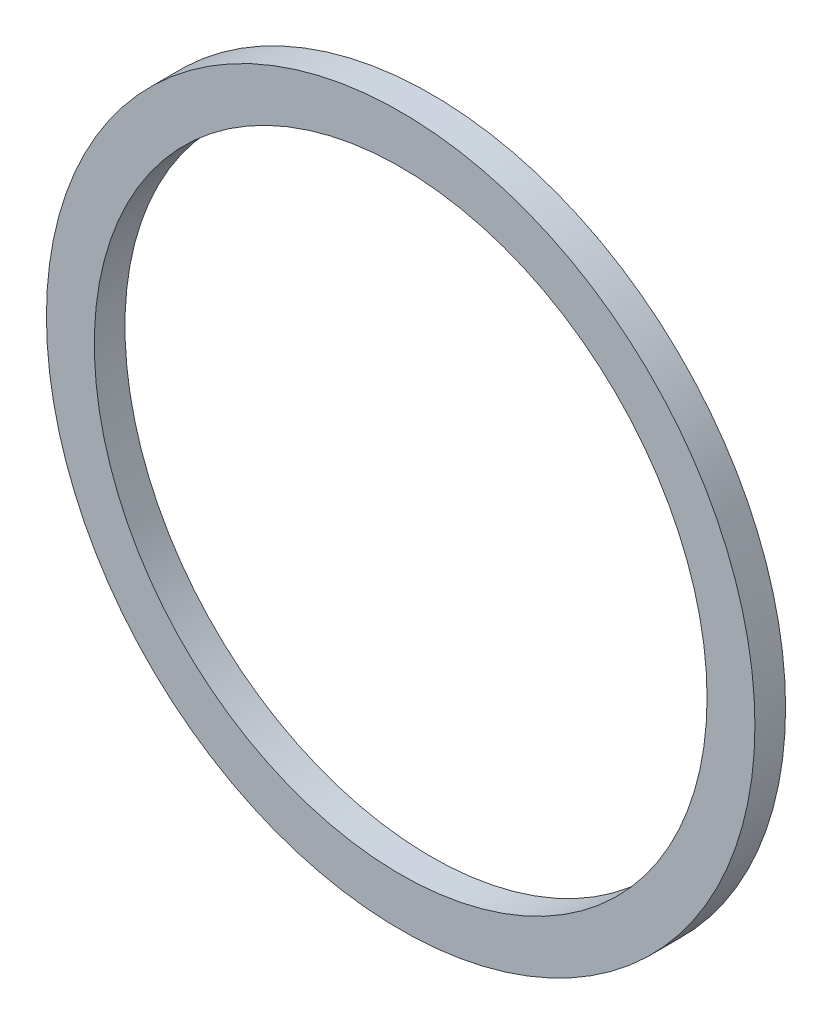
ISO-10303-21;
HEADER;
FILE_DESCRIPTION(('STEP AP214'),'2;1');
FILE_NAME('part.step','',(''),(''),'','','');
FILE_SCHEMA(('AUTOMOTIVE_DESIGN { 1 0 10303 214 1 1 1 1 }'));
ENDSEC;
DATA;
#1=APPLICATION_CONTEXT('core data for automotive mechanical design processes');
#2=APPLICATION_PROTOCOL_DEFINITION('international standard','automotive_design',2000,#1);
#3=PRODUCT_CONTEXT('',#1,'mechanical');
#4=PRODUCT('Part','Part','',(#3));
#5=PRODUCT_RELATED_PRODUCT_CATEGORY('part','',(#4));
#6=PRODUCT_DEFINITION_FORMATION('','',#4);
#7=PRODUCT_DEFINITION_CONTEXT('part definition',#1,'design');
#8=PRODUCT_DEFINITION('design','',#6,#7);
#9=PRODUCT_DEFINITION_SHAPE('','',#8);
#10=(LENGTH_UNIT() NAMED_UNIT(*) SI_UNIT(.MILLI.,.METRE.));
#11=(NAMED_UNIT(*) PLANE_ANGLE_UNIT() SI_UNIT($,.RADIAN.));
#12=(NAMED_UNIT(*) SI_UNIT($,.STERADIAN.) SOLID_ANGLE_UNIT());
#13=UNCERTAINTY_MEASURE_WITH_UNIT(LENGTH_MEASURE(1.E-05),#10,'distance_accuracy_value','');
#14=(GEOMETRIC_REPRESENTATION_CONTEXT(3) GLOBAL_UNCERTAINTY_ASSIGNED_CONTEXT((#13)) GLOBAL_UNIT_ASSIGNED_CONTEXT((#10,
#11,#12)) REPRESENTATION_CONTEXT('',''));
#15=CARTESIAN_POINT('',(0.,0.,0.));
#16=DIRECTION('',(0.,0.,1.));
#17=DIRECTION('',(1.,0.,0.));
#18=AXIS2_PLACEMENT_3D('',#15,#16,#17);
#19=CARTESIAN_POINT('',(0.,0.,-1.6));
#20=DIRECTION('',(0.,0.,-1.));
#21=DIRECTION('',(1.,0.,0.));
#22=AXIS2_PLACEMENT_3D('',#19,#20,#21);
#23=PLANE('',#22);
#24=CARTESIAN_POINT('',(0.,0.,-1.6));
#25=DIRECTION('',(0.,0.,1.));
#26=DIRECTION('',(1.,0.,0.));
#27=AXIS2_PLACEMENT_3D('',#24,#25,#26);
#28=CIRCLE('',#27,18.5);
#29=CARTESIAN_POINT('',(18.5,0.,-1.6));
#30=VERTEX_POINT('',#29);
#31=EDGE_CURVE('E10',#30,#30,#28,.T.);
#32=ORIENTED_EDGE('',*,*,#31,.F.);
#33=EDGE_LOOP('',(#32));
#34=FACE_BOUND('',#33,.T.);
#35=CARTESIAN_POINT('',(0.,0.,-1.6));
#36=DIRECTION('',(0.,0.,1.));
#37=DIRECTION('',(1.,0.,0.));
#38=AXIS2_PLACEMENT_3D('',#35,#36,#37);
#39=CIRCLE('',#38,16.);
#40=CARTESIAN_POINT('',(16.,0.,-1.6));
#41=VERTEX_POINT('',#40);
#42=EDGE_CURVE('E56',#41,#41,#39,.T.);
#43=ORIENTED_EDGE('',*,*,#42,.T.);
#44=EDGE_LOOP('',(#43));
#45=FACE_BOUND('',#44,.T.);
#46=ADVANCED_FACE('F43',(#34,#45),#23,.T.);
#47=CARTESIAN_POINT('',(0.,0.,0.));
#48=DIRECTION('',(0.,0.,-1.));
#49=DIRECTION('',(1.,0.,0.));
#50=AXIS2_PLACEMENT_3D('',#47,#48,#49);
#51=PLANE('',#50);
#52=CARTESIAN_POINT('',(0.,0.,0.));
#53=DIRECTION('',(0.,0.,1.));
#54=DIRECTION('',(1.,0.,0.));
#55=AXIS2_PLACEMENT_3D('',#52,#53,#54);
#56=CIRCLE('',#55,18.5);
#57=CARTESIAN_POINT('',(18.5,0.,0.));
#58=VERTEX_POINT('',#57);
#59=EDGE_CURVE('E47',#58,#58,#56,.T.);
#60=ORIENTED_EDGE('',*,*,#59,.T.);
#61=EDGE_LOOP('',(#60));
#62=FACE_BOUND('',#61,.T.);
#63=CARTESIAN_POINT('',(0.,0.,0.));
#64=DIRECTION('',(0.,0.,1.));
#65=DIRECTION('',(1.,0.,0.));
#66=AXIS2_PLACEMENT_3D('',#63,#64,#65);
#67=CIRCLE('',#66,16.);
#68=CARTESIAN_POINT('',(16.,0.,0.));
#69=VERTEX_POINT('',#68);
#70=EDGE_CURVE('E58',#69,#69,#67,.T.);
#71=ORIENTED_EDGE('',*,*,#70,.F.);
#72=EDGE_LOOP('',(#71));
#73=FACE_BOUND('',#72,.T.);
#74=ADVANCED_FACE('F73',(#62,#73),#51,.F.);
#75=CARTESIAN_POINT('',(0.,0.,-1.6));
#76=DIRECTION('',(0.,0.,1.));
#77=DIRECTION('',(-1.,0.,0.));
#78=AXIS2_PLACEMENT_3D('',#75,#76,#77);
#79=CYLINDRICAL_SURFACE('',#78,18.5);
#80=ORIENTED_EDGE('',*,*,#31,.T.);
#81=EDGE_LOOP('',(#80));
#82=FACE_BOUND('',#81,.T.);
#83=ORIENTED_EDGE('',*,*,#59,.F.);
#84=EDGE_LOOP('',(#83));
#85=FACE_BOUND('',#84,.T.);
#86=ADVANCED_FACE('F45',(#82,#85),#79,.T.);
#87=CARTESIAN_POINT('',(0.,0.,-1.6));
#88=DIRECTION('',(0.,0.,1.));
#89=DIRECTION('',(-1.,0.,0.));
#90=AXIS2_PLACEMENT_3D('',#87,#88,#89);
#91=CYLINDRICAL_SURFACE('',#90,16.);
#92=ORIENTED_EDGE('',*,*,#42,.F.);
#93=EDGE_LOOP('',(#92));
#94=FACE_BOUND('',#93,.T.);
#95=ORIENTED_EDGE('',*,*,#70,.T.);
#96=EDGE_LOOP('',(#95));
#97=FACE_BOUND('',#96,.T.);
#98=ADVANCED_FACE('F67',(#94,#97),#91,.F.);
#99=CLOSED_SHELL('',(#46,#74,#86,#98));
#100=MANIFOLD_SOLID_BREP('B2',#99);
#101=ADVANCED_BREP_SHAPE_REPRESENTATION('',(#18,#100),#14);
#102=SHAPE_DEFINITION_REPRESENTATION(#9,#101);
ENDSEC;
END-ISO-10303-21;
